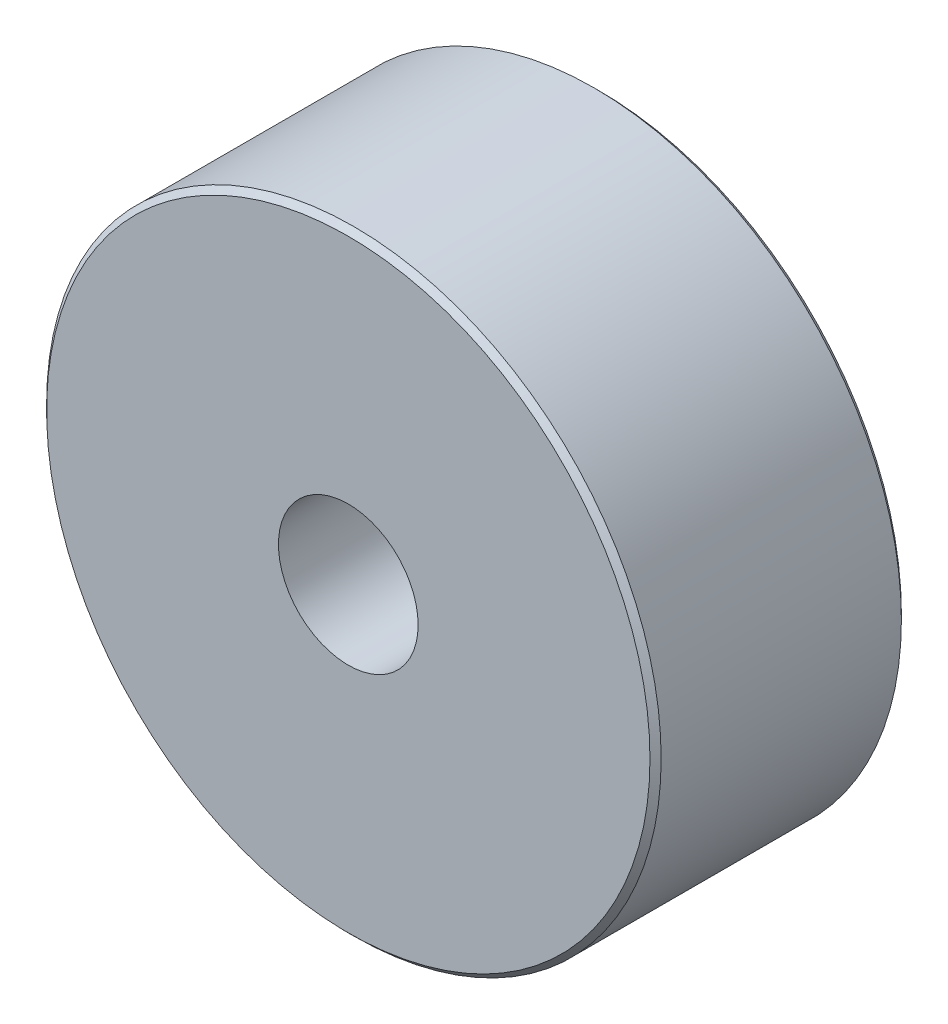
ISO-10303-21;
HEADER;
FILE_DESCRIPTION(('STEP AP214'),'2;1');
FILE_NAME('part.step','',(''),(''),'','','');
FILE_SCHEMA(('AUTOMOTIVE_DESIGN { 1 0 10303 214 1 1 1 1 }'));
ENDSEC;
DATA;
#1=APPLICATION_CONTEXT('core data for automotive mechanical design processes');
#2=APPLICATION_PROTOCOL_DEFINITION('international standard','automotive_design',2000,#1);
#3=PRODUCT_CONTEXT('',#1,'mechanical');
#4=PRODUCT('Part','Part','',(#3));
#5=PRODUCT_RELATED_PRODUCT_CATEGORY('part','',(#4));
#6=PRODUCT_DEFINITION_FORMATION('','',#4);
#7=PRODUCT_DEFINITION_CONTEXT('part definition',#1,'design');
#8=PRODUCT_DEFINITION('design','',#6,#7);
#9=PRODUCT_DEFINITION_SHAPE('','',#8);
#10=(LENGTH_UNIT() NAMED_UNIT(*) SI_UNIT(.MILLI.,.METRE.));
#11=(NAMED_UNIT(*) PLANE_ANGLE_UNIT() SI_UNIT($,.RADIAN.));
#12=(NAMED_UNIT(*) SI_UNIT($,.STERADIAN.) SOLID_ANGLE_UNIT());
#13=UNCERTAINTY_MEASURE_WITH_UNIT(LENGTH_MEASURE(1.E-05),#10,'distance_accuracy_value','');
#14=(GEOMETRIC_REPRESENTATION_CONTEXT(3) GLOBAL_UNCERTAINTY_ASSIGNED_CONTEXT((#13)) GLOBAL_UNIT_ASSIGNED_CONTEXT((#10,
#11,#12)) REPRESENTATION_CONTEXT('',''));
#15=CARTESIAN_POINT('',(0.,0.,0.));
#16=DIRECTION('',(0.,0.,1.));
#17=DIRECTION('',(1.,0.,0.));
#18=AXIS2_PLACEMENT_3D('',#15,#16,#17);
#19=CARTESIAN_POINT('',(0.,0.,4.5));
#20=DIRECTION('',(0.,0.,-1.));
#21=DIRECTION('',(-1.,0.,0.));
#22=AXIS2_PLACEMENT_3D('',#19,#20,#21);
#23=CYLINDRICAL_SURFACE('',#22,5.5);
#24=CARTESIAN_POINT('',(0.,0.,0.1));
#25=DIRECTION('',(0.,0.,1.));
#26=DIRECTION('',(1.,0.,0.));
#27=AXIS2_PLACEMENT_3D('',#24,#25,#26);
#28=CIRCLE('',#27,5.5);
#29=CARTESIAN_POINT('',(5.5,0.,0.1));
#30=VERTEX_POINT('',#29);
#31=EDGE_CURVE('E44',#30,#30,#28,.T.);
#32=ORIENTED_EDGE('',*,*,#31,.T.);
#33=EDGE_LOOP('',(#32));
#34=FACE_BOUND('',#33,.T.);
#35=CARTESIAN_POINT('',(0.,0.,4.4));
#36=DIRECTION('',(0.,0.,1.));
#37=DIRECTION('',(1.,0.,0.));
#38=AXIS2_PLACEMENT_3D('',#35,#36,#37);
#39=CIRCLE('',#38,5.5);
#40=CARTESIAN_POINT('',(5.5,0.,4.4));
#41=VERTEX_POINT('',#40);
#42=EDGE_CURVE('E48',#41,#41,#39,.F.);
#43=ORIENTED_EDGE('',*,*,#42,.T.);
#44=EDGE_LOOP('',(#43));
#45=FACE_BOUND('',#44,.T.);
#46=ADVANCED_FACE('F33',(#34,#45),#23,.T.);
#47=CARTESIAN_POINT('',(0.,0.,4.5));
#48=DIRECTION('',(0.,0.,1.));
#49=DIRECTION('',(1.,0.,0.));
#50=AXIS2_PLACEMENT_3D('',#47,#48,#49);
#51=PLANE('',#50);
#52=CARTESIAN_POINT('',(0.,0.,4.5));
#53=DIRECTION('',(0.,0.,1.));
#54=DIRECTION('',(1.,0.,0.));
#55=AXIS2_PLACEMENT_3D('',#52,#53,#54);
#56=CIRCLE('',#55,5.4);
#57=CARTESIAN_POINT('',(5.4,0.,4.5));
#58=VERTEX_POINT('',#57);
#59=EDGE_CURVE('E10',#58,#58,#56,.T.);
#60=ORIENTED_EDGE('',*,*,#59,.T.);
#61=EDGE_LOOP('',(#60));
#62=FACE_BOUND('',#61,.T.);
#63=CARTESIAN_POINT('',(0.,0.,4.5));
#64=DIRECTION('',(0.,0.,1.));
#65=DIRECTION('',(1.,0.,0.));
#66=AXIS2_PLACEMENT_3D('',#63,#64,#65);
#67=CIRCLE('',#66,1.24999999999999);
#68=CARTESIAN_POINT('',(1.24999999999999,0.,4.5));
#69=VERTEX_POINT('',#68);
#70=EDGE_CURVE('E56',#69,#69,#67,.T.);
#71=ORIENTED_EDGE('',*,*,#70,.F.);
#72=EDGE_LOOP('',(#71));
#73=FACE_BOUND('',#72,.T.);
#74=ADVANCED_FACE('F62',(#62,#73),#51,.T.);
#75=CARTESIAN_POINT('',(0.,0.,0.));
#76=DIRECTION('',(0.,0.,1.));
#77=DIRECTION('',(1.,0.,0.));
#78=AXIS2_PLACEMENT_3D('',#75,#76,#77);
#79=PLANE('',#78);
#80=CARTESIAN_POINT('',(0.,0.,0.));
#81=DIRECTION('',(0.,0.,1.));
#82=DIRECTION('',(1.,0.,0.));
#83=AXIS2_PLACEMENT_3D('',#80,#81,#82);
#84=CIRCLE('',#83,5.4);
#85=CARTESIAN_POINT('',(5.4,0.,0.));
#86=VERTEX_POINT('',#85);
#87=EDGE_CURVE('E40',#86,#86,#84,.F.);
#88=ORIENTED_EDGE('',*,*,#87,.T.);
#89=EDGE_LOOP('',(#88));
#90=FACE_BOUND('',#89,.T.);
#91=CARTESIAN_POINT('',(0.,0.,0.));
#92=DIRECTION('',(0.,0.,1.));
#93=DIRECTION('',(1.,0.,0.));
#94=AXIS2_PLACEMENT_3D('',#91,#92,#93);
#95=CIRCLE('',#94,1.25);
#96=CARTESIAN_POINT('',(1.25,0.,0.));
#97=VERTEX_POINT('',#96);
#98=EDGE_CURVE('E53',#97,#97,#95,.T.);
#99=ORIENTED_EDGE('',*,*,#98,.T.);
#100=EDGE_LOOP('',(#99));
#101=FACE_BOUND('',#100,.T.);
#102=ADVANCED_FACE('F64',(#90,#101),#79,.F.);
#103=CARTESIAN_POINT('',(0.,0.,4.5));
#104=DIRECTION('',(0.,0.,1.));
#105=DIRECTION('',(1.,0.,0.));
#106=AXIS2_PLACEMENT_3D('',#103,#104,#105);
#107=CYLINDRICAL_SURFACE('',#106,1.24999999999999);
#108=ORIENTED_EDGE('',*,*,#98,.F.);
#109=EDGE_LOOP('',(#108));
#110=FACE_BOUND('',#109,.T.);
#111=ORIENTED_EDGE('',*,*,#70,.T.);
#112=EDGE_LOOP('',(#111));
#113=FACE_BOUND('',#112,.T.);
#114=ADVANCED_FACE('F60',(#110,#113),#107,.F.);
#115=CARTESIAN_POINT('',(0.,0.,0.1));
#116=DIRECTION('',(0.,0.,1.));
#117=DIRECTION('',(1.,0.,0.));
#118=AXIS2_PLACEMENT_3D('',#115,#116,#117);
#119=CONICAL_SURFACE('',#118,5.5,0.785398163397448);
#120=ORIENTED_EDGE('',*,*,#87,.F.);
#121=EDGE_LOOP('',(#120));
#122=FACE_BOUND('',#121,.T.);
#123=ORIENTED_EDGE('',*,*,#31,.F.);
#124=EDGE_LOOP('',(#123));
#125=FACE_BOUND('',#124,.T.);
#126=ADVANCED_FACE('F74',(#122,#125),#119,.T.);
#127=CARTESIAN_POINT('',(0.,0.,4.5));
#128=DIRECTION('',(0.,0.,-1.));
#129=DIRECTION('',(-1.,0.,0.));
#130=AXIS2_PLACEMENT_3D('',#127,#128,#129);
#131=CONICAL_SURFACE('',#130,5.4,0.785398163397448);
#132=ORIENTED_EDGE('',*,*,#42,.F.);
#133=EDGE_LOOP('',(#132));
#134=FACE_BOUND('',#133,.T.);
#135=ORIENTED_EDGE('',*,*,#59,.F.);
#136=EDGE_LOOP('',(#135));
#137=FACE_BOUND('',#136,.T.);
#138=ADVANCED_FACE('F35',(#134,#137),#131,.T.);
#139=CLOSED_SHELL('',(#46,#74,#102,#114,#126,#138));
#140=MANIFOLD_SOLID_BREP('B2',#139);
#141=ADVANCED_BREP_SHAPE_REPRESENTATION('',(#18,#140),#14);
#142=SHAPE_DEFINITION_REPRESENTATION(#9,#141);
ENDSEC;
END-ISO-10303-21;
